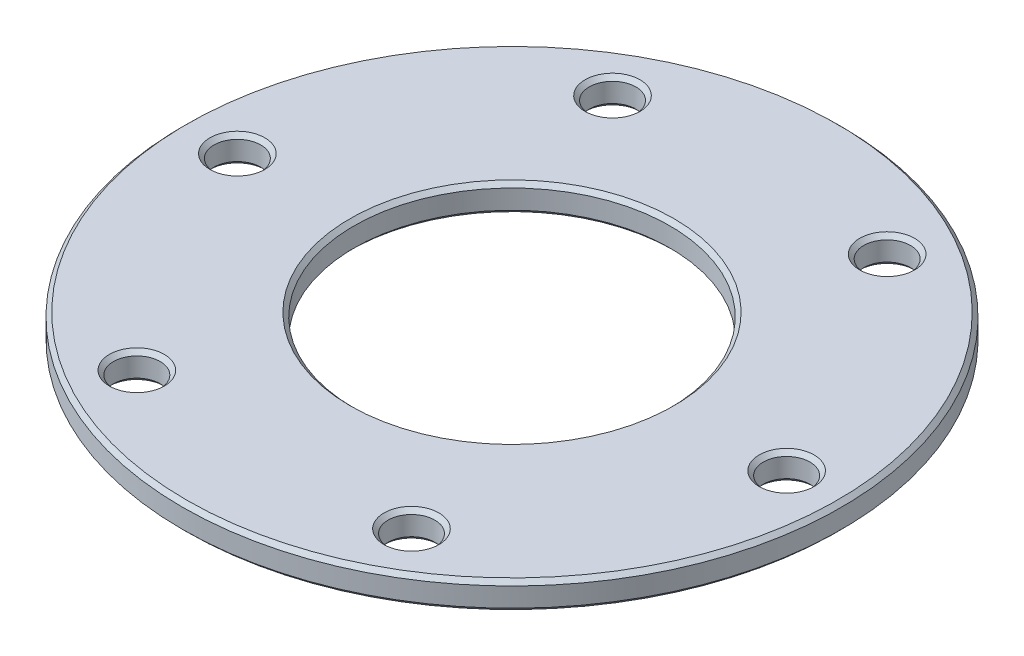
ISO-10303-21;
HEADER;
FILE_DESCRIPTION(('STEP AP214'),'2;1');
FILE_NAME('part.step','',(''),(''),'','','');
FILE_SCHEMA(('AUTOMOTIVE_DESIGN { 1 0 10303 214 1 1 1 1 }'));
ENDSEC;
DATA;
#1=APPLICATION_CONTEXT('core data for automotive mechanical design processes');
#2=APPLICATION_PROTOCOL_DEFINITION('international standard','automotive_design',2000,#1);
#3=PRODUCT_CONTEXT('',#1,'mechanical');
#4=PRODUCT('Part','Part','',(#3));
#5=PRODUCT_RELATED_PRODUCT_CATEGORY('part','',(#4));
#6=PRODUCT_DEFINITION_FORMATION('','',#4);
#7=PRODUCT_DEFINITION_CONTEXT('part definition',#1,'design');
#8=PRODUCT_DEFINITION('design','',#6,#7);
#9=PRODUCT_DEFINITION_SHAPE('','',#8);
#10=(LENGTH_UNIT() NAMED_UNIT(*) SI_UNIT(.MILLI.,.METRE.));
#11=(NAMED_UNIT(*) PLANE_ANGLE_UNIT() SI_UNIT($,.RADIAN.));
#12=(NAMED_UNIT(*) SI_UNIT($,.STERADIAN.) SOLID_ANGLE_UNIT());
#13=UNCERTAINTY_MEASURE_WITH_UNIT(LENGTH_MEASURE(1.E-05),#10,'distance_accuracy_value','');
#14=(GEOMETRIC_REPRESENTATION_CONTEXT(3) GLOBAL_UNCERTAINTY_ASSIGNED_CONTEXT((#13)) GLOBAL_UNIT_ASSIGNED_CONTEXT((#10,
#11,#12)) REPRESENTATION_CONTEXT('',''));
#15=CARTESIAN_POINT('',(0.,0.,0.));
#16=DIRECTION('',(0.,0.,1.));
#17=DIRECTION('',(1.,0.,0.));
#18=AXIS2_PLACEMENT_3D('',#15,#16,#17);
#19=CARTESIAN_POINT('',(0.,2.,0.));
#20=DIRECTION('',(0.,1.,0.));
#21=DIRECTION('',(0.,0.,1.));
#22=AXIS2_PLACEMENT_3D('',#19,#20,#21);
#23=PLANE('',#22);
#24=CARTESIAN_POINT('',(10.,2.,17.3205080756888));
#25=DIRECTION('',(0.,1.,0.));
#26=DIRECTION('',(0.,0.,1.));
#27=AXIS2_PLACEMENT_3D('',#24,#25,#26);
#28=CIRCLE('',#27,2.00000000000001);
#29=CARTESIAN_POINT('',(10.,2.,19.3205080756888));
#30=VERTEX_POINT('',#29);
#31=EDGE_CURVE('E105',#30,#30,#28,.F.);
#32=ORIENTED_EDGE('',*,*,#31,.T.);
#33=EDGE_LOOP('',(#32));
#34=FACE_BOUND('',#33,.T.);
#35=CARTESIAN_POINT('',(0.,2.,0.));
#36=DIRECTION('',(0.,1.,0.));
#37=DIRECTION('',(0.,0.,1.));
#38=AXIS2_PLACEMENT_3D('',#35,#36,#37);
#39=CIRCLE('',#38,11.8);
#40=CARTESIAN_POINT('',(0.,2.,11.8));
#41=VERTEX_POINT('',#40);
#42=EDGE_CURVE('E108',#41,#41,#39,.F.);
#43=ORIENTED_EDGE('',*,*,#42,.T.);
#44=EDGE_LOOP('',(#43));
#45=FACE_BOUND('',#44,.T.);
#46=CARTESIAN_POINT('',(0.,2.,0.));
#47=DIRECTION('',(0.,1.,0.));
#48=DIRECTION('',(0.,0.,1.));
#49=AXIS2_PLACEMENT_3D('',#46,#47,#48);
#50=CIRCLE('',#49,23.7);
#51=CARTESIAN_POINT('',(0.,2.,23.7));
#52=VERTEX_POINT('',#51);
#53=EDGE_CURVE('E111',#52,#52,#50,.T.);
#54=ORIENTED_EDGE('',*,*,#53,.T.);
#55=EDGE_LOOP('',(#54));
#56=FACE_BOUND('',#55,.T.);
#57=CARTESIAN_POINT('',(-10.,2.,-17.3205080756888));
#58=DIRECTION('',(0.,1.,0.));
#59=DIRECTION('',(0.,0.,1.));
#60=AXIS2_PLACEMENT_3D('',#57,#58,#59);
#61=CIRCLE('',#60,2.00000000000001);
#62=CARTESIAN_POINT('',(-10.,2.,-15.3205080756888));
#63=VERTEX_POINT('',#62);
#64=EDGE_CURVE('E114',#63,#63,#61,.F.);
#65=ORIENTED_EDGE('',*,*,#64,.T.);
#66=EDGE_LOOP('',(#65));
#67=FACE_BOUND('',#66,.T.);
#68=CARTESIAN_POINT('',(-20.,2.,0.));
#69=DIRECTION('',(0.,1.,0.));
#70=DIRECTION('',(0.,0.,1.));
#71=AXIS2_PLACEMENT_3D('',#68,#69,#70);
#72=CIRCLE('',#71,1.99999999999999);
#73=CARTESIAN_POINT('',(-20.,2.,1.99999999999999));
#74=VERTEX_POINT('',#73);
#75=EDGE_CURVE('E117',#74,#74,#72,.F.);
#76=ORIENTED_EDGE('',*,*,#75,.T.);
#77=EDGE_LOOP('',(#76));
#78=FACE_BOUND('',#77,.T.);
#79=CARTESIAN_POINT('',(9.99999999999999,2.,-17.3205080756888));
#80=DIRECTION('',(0.,1.,0.));
#81=DIRECTION('',(0.,0.,1.));
#82=AXIS2_PLACEMENT_3D('',#79,#80,#81);
#83=CIRCLE('',#82,2.00000000000001);
#84=CARTESIAN_POINT('',(9.99999999999999,2.,-15.3205080756888));
#85=VERTEX_POINT('',#84);
#86=EDGE_CURVE('E120',#85,#85,#83,.F.);
#87=ORIENTED_EDGE('',*,*,#86,.T.);
#88=EDGE_LOOP('',(#87));
#89=FACE_BOUND('',#88,.T.);
#90=CARTESIAN_POINT('',(20.,2.,0.));
#91=DIRECTION('',(0.,1.,0.));
#92=DIRECTION('',(0.,0.,1.));
#93=AXIS2_PLACEMENT_3D('',#90,#91,#92);
#94=CIRCLE('',#93,1.99999999999999);
#95=CARTESIAN_POINT('',(20.,2.,1.99999999999998));
#96=VERTEX_POINT('',#95);
#97=EDGE_CURVE('E123',#96,#96,#94,.F.);
#98=ORIENTED_EDGE('',*,*,#97,.T.);
#99=EDGE_LOOP('',(#98));
#100=FACE_BOUND('',#99,.T.);
#101=CARTESIAN_POINT('',(-9.99999999999998,2.,17.3205080756888));
#102=DIRECTION('',(0.,1.,0.));
#103=DIRECTION('',(0.,0.,1.));
#104=AXIS2_PLACEMENT_3D('',#101,#102,#103);
#105=CIRCLE('',#104,2.00000000000001);
#106=CARTESIAN_POINT('',(-9.99999999999998,2.,19.3205080756888));
#107=VERTEX_POINT('',#106);
#108=EDGE_CURVE('E126',#107,#107,#105,.F.);
#109=ORIENTED_EDGE('',*,*,#108,.T.);
#110=EDGE_LOOP('',(#109));
#111=FACE_BOUND('',#110,.T.);
#112=ADVANCED_FACE('F31',(#34,#45,#56,#67,#78,#89,#100,#111),#23,.T.);
#113=CARTESIAN_POINT('',(0.,0.,0.));
#114=DIRECTION('',(0.,1.,0.));
#115=DIRECTION('',(0.,0.,1.));
#116=AXIS2_PLACEMENT_3D('',#113,#114,#115);
#117=PLANE('',#116);
#118=CARTESIAN_POINT('',(10.,0.,17.3205080756888));
#119=DIRECTION('',(0.,1.,0.));
#120=DIRECTION('',(0.,0.,1.));
#121=AXIS2_PLACEMENT_3D('',#118,#119,#120);
#122=CIRCLE('',#121,2.);
#123=CARTESIAN_POINT('',(10.,0.,19.3205080756888));
#124=VERTEX_POINT('',#123);
#125=EDGE_CURVE('E81',#124,#124,#122,.T.);
#126=ORIENTED_EDGE('',*,*,#125,.T.);
#127=EDGE_LOOP('',(#126));
#128=FACE_BOUND('',#127,.T.);
#129=CARTESIAN_POINT('',(0.,0.,0.));
#130=DIRECTION('',(0.,1.,0.));
#131=DIRECTION('',(0.,0.,1.));
#132=AXIS2_PLACEMENT_3D('',#129,#130,#131);
#133=CIRCLE('',#132,11.8);
#134=CARTESIAN_POINT('',(0.,0.,11.8));
#135=VERTEX_POINT('',#134);
#136=EDGE_CURVE('E84',#135,#135,#133,.T.);
#137=ORIENTED_EDGE('',*,*,#136,.T.);
#138=EDGE_LOOP('',(#137));
#139=FACE_BOUND('',#138,.T.);
#140=CARTESIAN_POINT('',(0.,0.,0.));
#141=DIRECTION('',(0.,1.,0.));
#142=DIRECTION('',(0.,0.,1.));
#143=AXIS2_PLACEMENT_3D('',#140,#141,#142);
#144=CIRCLE('',#143,23.7);
#145=CARTESIAN_POINT('',(0.,0.,23.7));
#146=VERTEX_POINT('',#145);
#147=EDGE_CURVE('E87',#146,#146,#144,.F.);
#148=ORIENTED_EDGE('',*,*,#147,.T.);
#149=EDGE_LOOP('',(#148));
#150=FACE_BOUND('',#149,.T.);
#151=CARTESIAN_POINT('',(9.99999999999999,0.,-17.3205080756888));
#152=DIRECTION('',(0.,1.,0.));
#153=DIRECTION('',(0.,0.,1.));
#154=AXIS2_PLACEMENT_3D('',#151,#152,#153);
#155=CIRCLE('',#154,2.00000000000002);
#156=CARTESIAN_POINT('',(9.99999999999999,0.,-15.3205080756888));
#157=VERTEX_POINT('',#156);
#158=EDGE_CURVE('E90',#157,#157,#155,.T.);
#159=ORIENTED_EDGE('',*,*,#158,.T.);
#160=EDGE_LOOP('',(#159));
#161=FACE_BOUND('',#160,.T.);
#162=CARTESIAN_POINT('',(20.,0.,0.));
#163=DIRECTION('',(0.,1.,0.));
#164=DIRECTION('',(0.,0.,1.));
#165=AXIS2_PLACEMENT_3D('',#162,#163,#164);
#166=CIRCLE('',#165,1.99999999999998);
#167=CARTESIAN_POINT('',(20.,0.,1.99999999999998));
#168=VERTEX_POINT('',#167);
#169=EDGE_CURVE('E93',#168,#168,#166,.T.);
#170=ORIENTED_EDGE('',*,*,#169,.T.);
#171=EDGE_LOOP('',(#170));
#172=FACE_BOUND('',#171,.T.);
#173=CARTESIAN_POINT('',(-9.99999999999998,0.,17.3205080756888));
#174=DIRECTION('',(0.,1.,0.));
#175=DIRECTION('',(0.,0.,1.));
#176=AXIS2_PLACEMENT_3D('',#173,#174,#175);
#177=CIRCLE('',#176,2.);
#178=CARTESIAN_POINT('',(-9.99999999999998,0.,19.3205080756888));
#179=VERTEX_POINT('',#178);
#180=EDGE_CURVE('E96',#179,#179,#177,.T.);
#181=ORIENTED_EDGE('',*,*,#180,.T.);
#182=EDGE_LOOP('',(#181));
#183=FACE_BOUND('',#182,.T.);
#184=CARTESIAN_POINT('',(-20.,0.,0.));
#185=DIRECTION('',(0.,1.,0.));
#186=DIRECTION('',(0.,0.,1.));
#187=AXIS2_PLACEMENT_3D('',#184,#185,#186);
#188=CIRCLE('',#187,1.99999999999998);
#189=CARTESIAN_POINT('',(-20.,0.,1.99999999999998));
#190=VERTEX_POINT('',#189);
#191=EDGE_CURVE('E99',#190,#190,#188,.T.);
#192=ORIENTED_EDGE('',*,*,#191,.T.);
#193=EDGE_LOOP('',(#192));
#194=FACE_BOUND('',#193,.T.);
#195=CARTESIAN_POINT('',(-10.,0.,-17.3205080756888));
#196=DIRECTION('',(0.,1.,0.));
#197=DIRECTION('',(0.,0.,1.));
#198=AXIS2_PLACEMENT_3D('',#195,#196,#197);
#199=CIRCLE('',#198,2.00000000000001);
#200=CARTESIAN_POINT('',(-10.,0.,-15.3205080756888));
#201=VERTEX_POINT('',#200);
#202=EDGE_CURVE('E102',#201,#201,#199,.T.);
#203=ORIENTED_EDGE('',*,*,#202,.T.);
#204=EDGE_LOOP('',(#203));
#205=FACE_BOUND('',#204,.T.);
#206=ADVANCED_FACE('F146',(#128,#139,#150,#161,#172,#183,#194,#205),#117,.F.);
#207=CARTESIAN_POINT('',(0.,2.,0.));
#208=DIRECTION('',(0.,-1.,0.));
#209=DIRECTION('',(0.,0.,-1.));
#210=AXIS2_PLACEMENT_3D('',#207,#208,#209);
#211=CYLINDRICAL_SURFACE('',#210,24.);
#212=CARTESIAN_POINT('',(0.,0.300000000000002,0.));
#213=DIRECTION('',(0.,1.,0.));
#214=DIRECTION('',(0.,0.,1.));
#215=AXIS2_PLACEMENT_3D('',#212,#213,#214);
#216=CIRCLE('',#215,24.);
#217=CARTESIAN_POINT('',(0.,0.300000000000002,24.));
#218=VERTEX_POINT('',#217);
#219=EDGE_CURVE('E69',#218,#218,#216,.T.);
#220=ORIENTED_EDGE('',*,*,#219,.T.);
#221=EDGE_LOOP('',(#220));
#222=FACE_BOUND('',#221,.T.);
#223=CARTESIAN_POINT('',(0.,1.69999999999999,0.));
#224=DIRECTION('',(0.,1.,0.));
#225=DIRECTION('',(0.,0.,1.));
#226=AXIS2_PLACEMENT_3D('',#223,#224,#225);
#227=CIRCLE('',#226,24.);
#228=CARTESIAN_POINT('',(0.,1.69999999999999,24.));
#229=VERTEX_POINT('',#228);
#230=EDGE_CURVE('E72',#229,#229,#227,.F.);
#231=ORIENTED_EDGE('',*,*,#230,.T.);
#232=EDGE_LOOP('',(#231));
#233=FACE_BOUND('',#232,.T.);
#234=ADVANCED_FACE('F149',(#222,#233),#211,.T.);
#235=CARTESIAN_POINT('',(0.,2.,0.));
#236=DIRECTION('',(0.,-1.,0.));
#237=DIRECTION('',(0.,0.,-1.));
#238=AXIS2_PLACEMENT_3D('',#235,#236,#237);
#239=CYLINDRICAL_SURFACE('',#238,11.5);
#240=CARTESIAN_POINT('',(0.,0.300000000000009,0.));
#241=DIRECTION('',(0.,1.,0.));
#242=DIRECTION('',(0.,0.,1.));
#243=AXIS2_PLACEMENT_3D('',#240,#241,#242);
#244=CIRCLE('',#243,11.5);
#245=CARTESIAN_POINT('',(0.,0.300000000000009,11.5));
#246=VERTEX_POINT('',#245);
#247=EDGE_CURVE('E75',#246,#246,#244,.F.);
#248=ORIENTED_EDGE('',*,*,#247,.T.);
#249=EDGE_LOOP('',(#248));
#250=FACE_BOUND('',#249,.T.);
#251=CARTESIAN_POINT('',(0.,1.70000000000002,0.));
#252=DIRECTION('',(0.,1.,0.));
#253=DIRECTION('',(0.,0.,1.));
#254=AXIS2_PLACEMENT_3D('',#251,#252,#253);
#255=CIRCLE('',#254,11.5);
#256=CARTESIAN_POINT('',(0.,1.70000000000002,11.5));
#257=VERTEX_POINT('',#256);
#258=EDGE_CURVE('E78',#257,#257,#255,.T.);
#259=ORIENTED_EDGE('',*,*,#258,.T.);
#260=EDGE_LOOP('',(#259));
#261=FACE_BOUND('',#260,.T.);
#262=ADVANCED_FACE('F188',(#250,#261),#239,.F.);
#263=CARTESIAN_POINT('',(-10.,0.,-17.3205080756888));
#264=DIRECTION('',(0.,1.,0.));
#265=DIRECTION('',(0.,0.,1.));
#266=AXIS2_PLACEMENT_3D('',#263,#264,#265);
#267=CYLINDRICAL_SURFACE('',#266,1.7);
#268=CARTESIAN_POINT('',(-10.,0.30000000000001,-17.3205080756888));
#269=DIRECTION('',(0.,1.,0.));
#270=DIRECTION('',(0.,0.,1.));
#271=AXIS2_PLACEMENT_3D('',#268,#269,#270);
#272=CIRCLE('',#271,1.7);
#273=CARTESIAN_POINT('',(-10.,0.30000000000001,-15.6205080756888));
#274=VERTEX_POINT('',#273);
#275=EDGE_CURVE('E10',#274,#274,#272,.F.);
#276=ORIENTED_EDGE('',*,*,#275,.T.);
#277=EDGE_LOOP('',(#276));
#278=FACE_BOUND('',#277,.T.);
#279=CARTESIAN_POINT('',(-10.,1.69999999999999,-17.3205080756888));
#280=DIRECTION('',(0.,1.,0.));
#281=DIRECTION('',(0.,0.,1.));
#282=AXIS2_PLACEMENT_3D('',#279,#280,#281);
#283=CIRCLE('',#282,1.7);
#284=CARTESIAN_POINT('',(-10.,1.69999999999999,-15.6205080756888));
#285=VERTEX_POINT('',#284);
#286=EDGE_CURVE('E38',#285,#285,#283,.T.);
#287=ORIENTED_EDGE('',*,*,#286,.T.);
#288=EDGE_LOOP('',(#287));
#289=FACE_BOUND('',#288,.T.);
#290=ADVANCED_FACE('F266',(#278,#289),#267,.F.);
#291=CARTESIAN_POINT('',(9.99999999999999,0.,-17.3205080756888));
#292=DIRECTION('',(0.,1.,0.));
#293=DIRECTION('',(0.,0.,1.));
#294=AXIS2_PLACEMENT_3D('',#291,#292,#293);
#295=CYLINDRICAL_SURFACE('',#294,1.7);
#296=CARTESIAN_POINT('',(9.99999999999999,0.300000000000015,-17.3205080756888));
#297=DIRECTION('',(0.,1.,0.));
#298=DIRECTION('',(0.,0.,1.));
#299=AXIS2_PLACEMENT_3D('',#296,#297,#298);
#300=CIRCLE('',#299,1.7);
#301=CARTESIAN_POINT('',(9.99999999999999,0.300000000000015,-15.6205080756888));
#302=VERTEX_POINT('',#301);
#303=EDGE_CURVE('E63',#302,#302,#300,.F.);
#304=ORIENTED_EDGE('',*,*,#303,.T.);
#305=EDGE_LOOP('',(#304));
#306=FACE_BOUND('',#305,.T.);
#307=CARTESIAN_POINT('',(9.99999999999999,1.69999999999999,-17.3205080756888));
#308=DIRECTION('',(0.,1.,0.));
#309=DIRECTION('',(0.,0.,1.));
#310=AXIS2_PLACEMENT_3D('',#307,#308,#309);
#311=CIRCLE('',#310,1.7);
#312=CARTESIAN_POINT('',(9.99999999999999,1.69999999999999,-15.6205080756888));
#313=VERTEX_POINT('',#312);
#314=EDGE_CURVE('E66',#313,#313,#311,.T.);
#315=ORIENTED_EDGE('',*,*,#314,.T.);
#316=EDGE_LOOP('',(#315));
#317=FACE_BOUND('',#316,.T.);
#318=ADVANCED_FACE('F269',(#306,#317),#295,.F.);
#319=CARTESIAN_POINT('',(20.,0.,0.));
#320=DIRECTION('',(0.,1.,0.));
#321=DIRECTION('',(0.,0.,1.));
#322=AXIS2_PLACEMENT_3D('',#319,#320,#321);
#323=CYLINDRICAL_SURFACE('',#322,1.7);
#324=CARTESIAN_POINT('',(20.,0.299999999999982,0.));
#325=DIRECTION('',(0.,1.,0.));
#326=DIRECTION('',(0.,0.,1.));
#327=AXIS2_PLACEMENT_3D('',#324,#325,#326);
#328=CIRCLE('',#327,1.7);
#329=CARTESIAN_POINT('',(20.,0.299999999999982,1.69999999999999));
#330=VERTEX_POINT('',#329);
#331=EDGE_CURVE('E57',#330,#330,#328,.F.);
#332=ORIENTED_EDGE('',*,*,#331,.T.);
#333=EDGE_LOOP('',(#332));
#334=FACE_BOUND('',#333,.T.);
#335=CARTESIAN_POINT('',(20.,1.70000000000001,0.));
#336=DIRECTION('',(0.,1.,0.));
#337=DIRECTION('',(0.,0.,1.));
#338=AXIS2_PLACEMENT_3D('',#335,#336,#337);
#339=CIRCLE('',#338,1.7);
#340=CARTESIAN_POINT('',(20.,1.70000000000001,1.69999999999999));
#341=VERTEX_POINT('',#340);
#342=EDGE_CURVE('E60',#341,#341,#339,.T.);
#343=ORIENTED_EDGE('',*,*,#342,.T.);
#344=EDGE_LOOP('',(#343));
#345=FACE_BOUND('',#344,.T.);
#346=ADVANCED_FACE('F272',(#334,#345),#323,.F.);
#347=CARTESIAN_POINT('',(10.,0.,17.3205080756888));
#348=DIRECTION('',(0.,1.,0.));
#349=DIRECTION('',(0.,0.,1.));
#350=AXIS2_PLACEMENT_3D('',#347,#348,#349);
#351=CYLINDRICAL_SURFACE('',#350,1.7);
#352=CARTESIAN_POINT('',(10.,1.69999999999999,17.3205080756888));
#353=DIRECTION('',(0.,1.,0.));
#354=DIRECTION('',(0.,0.,1.));
#355=AXIS2_PLACEMENT_3D('',#352,#353,#354);
#356=CIRCLE('',#355,1.7);
#357=CARTESIAN_POINT('',(10.,1.69999999999999,19.0205080756888));
#358=VERTEX_POINT('',#357);
#359=EDGE_CURVE('E129',#358,#358,#356,.T.);
#360=ORIENTED_EDGE('',*,*,#359,.T.);
#361=EDGE_LOOP('',(#360));
#362=FACE_BOUND('',#361,.T.);
#363=CARTESIAN_POINT('',(10.,0.300000000000009,17.3205080756888));
#364=DIRECTION('',(0.,1.,0.));
#365=DIRECTION('',(0.,0.,1.));
#366=AXIS2_PLACEMENT_3D('',#363,#364,#365);
#367=CIRCLE('',#366,1.7);
#368=CARTESIAN_POINT('',(10.,0.300000000000009,19.0205080756888));
#369=VERTEX_POINT('',#368);
#370=EDGE_CURVE('E132',#369,#369,#367,.F.);
#371=ORIENTED_EDGE('',*,*,#370,.T.);
#372=EDGE_LOOP('',(#371));
#373=FACE_BOUND('',#372,.T.);
#374=ADVANCED_FACE('F136',(#362,#373),#351,.F.);
#375=CARTESIAN_POINT('',(-9.99999999999998,0.,17.3205080756888));
#376=DIRECTION('',(0.,1.,0.));
#377=DIRECTION('',(0.,0.,1.));
#378=AXIS2_PLACEMENT_3D('',#375,#376,#377);
#379=CYLINDRICAL_SURFACE('',#378,1.7);
#380=CARTESIAN_POINT('',(-9.99999999999998,0.300000000000009,17.3205080756888));
#381=DIRECTION('',(0.,1.,0.));
#382=DIRECTION('',(0.,0.,1.));
#383=AXIS2_PLACEMENT_3D('',#380,#381,#382);
#384=CIRCLE('',#383,1.7);
#385=CARTESIAN_POINT('',(-9.99999999999998,0.300000000000009,19.0205080756888));
#386=VERTEX_POINT('',#385);
#387=EDGE_CURVE('E51',#386,#386,#384,.F.);
#388=ORIENTED_EDGE('',*,*,#387,.T.);
#389=EDGE_LOOP('',(#388));
#390=FACE_BOUND('',#389,.T.);
#391=CARTESIAN_POINT('',(-9.99999999999998,1.69999999999999,17.3205080756888));
#392=DIRECTION('',(0.,1.,0.));
#393=DIRECTION('',(0.,0.,1.));
#394=AXIS2_PLACEMENT_3D('',#391,#392,#393);
#395=CIRCLE('',#394,1.7);
#396=CARTESIAN_POINT('',(-9.99999999999998,1.69999999999999,19.0205080756888));
#397=VERTEX_POINT('',#396);
#398=EDGE_CURVE('E54',#397,#397,#395,.T.);
#399=ORIENTED_EDGE('',*,*,#398,.T.);
#400=EDGE_LOOP('',(#399));
#401=FACE_BOUND('',#400,.T.);
#402=ADVANCED_FACE('F228',(#390,#401),#379,.F.);
#403=CARTESIAN_POINT('',(-20.,0.,0.));
#404=DIRECTION('',(0.,1.,0.));
#405=DIRECTION('',(0.,0.,1.));
#406=AXIS2_PLACEMENT_3D('',#403,#404,#405);
#407=CYLINDRICAL_SURFACE('',#406,1.7);
#408=CARTESIAN_POINT('',(-20.,0.299999999999982,0.));
#409=DIRECTION('',(0.,1.,0.));
#410=DIRECTION('',(0.,0.,1.));
#411=AXIS2_PLACEMENT_3D('',#408,#409,#410);
#412=CIRCLE('',#411,1.7);
#413=CARTESIAN_POINT('',(-20.,0.299999999999982,1.7));
#414=VERTEX_POINT('',#413);
#415=EDGE_CURVE('E42',#414,#414,#412,.F.);
#416=ORIENTED_EDGE('',*,*,#415,.T.);
#417=EDGE_LOOP('',(#416));
#418=FACE_BOUND('',#417,.T.);
#419=CARTESIAN_POINT('',(-20.,1.70000000000001,0.));
#420=DIRECTION('',(0.,1.,0.));
#421=DIRECTION('',(0.,0.,1.));
#422=AXIS2_PLACEMENT_3D('',#419,#420,#421);
#423=CIRCLE('',#422,1.7);
#424=CARTESIAN_POINT('',(-20.,1.70000000000001,1.7));
#425=VERTEX_POINT('',#424);
#426=EDGE_CURVE('E46',#425,#425,#423,.T.);
#427=ORIENTED_EDGE('',*,*,#426,.T.);
#428=EDGE_LOOP('',(#427));
#429=FACE_BOUND('',#428,.T.);
#430=ADVANCED_FACE('F195',(#418,#429),#407,.F.);
#431=CARTESIAN_POINT('',(10.,1.69999999999999,17.3205080756888));
#432=DIRECTION('',(0.,1.,0.));
#433=DIRECTION('',(0.,0.,1.));
#434=AXIS2_PLACEMENT_3D('',#431,#432,#433);
#435=CONICAL_SURFACE('',#434,1.7,0.785398163397453);
#436=ORIENTED_EDGE('',*,*,#31,.F.);
#437=EDGE_LOOP('',(#436));
#438=FACE_BOUND('',#437,.T.);
#439=ORIENTED_EDGE('',*,*,#359,.F.);
#440=EDGE_LOOP('',(#439));
#441=FACE_BOUND('',#440,.T.);
#442=ADVANCED_FACE('F142',(#438,#441),#435,.F.);
#443=CARTESIAN_POINT('',(10.,0.,17.3205080756888));
#444=DIRECTION('',(0.,-1.,0.));
#445=DIRECTION('',(0.,0.,-1.));
#446=AXIS2_PLACEMENT_3D('',#443,#444,#445);
#447=CONICAL_SURFACE('',#446,2.,0.785398163397437);
#448=ORIENTED_EDGE('',*,*,#370,.F.);
#449=EDGE_LOOP('',(#448));
#450=FACE_BOUND('',#449,.T.);
#451=ORIENTED_EDGE('',*,*,#125,.F.);
#452=EDGE_LOOP('',(#451));
#453=FACE_BOUND('',#452,.T.);
#454=ADVANCED_FACE('F138',(#450,#453),#447,.F.);
#455=CARTESIAN_POINT('',(0.,0.,0.));
#456=DIRECTION('',(0.,-1.,0.));
#457=DIRECTION('',(0.,0.,-1.));
#458=AXIS2_PLACEMENT_3D('',#455,#456,#457);
#459=CONICAL_SURFACE('',#458,11.8,0.785398163397443);
#460=ORIENTED_EDGE('',*,*,#247,.F.);
#461=EDGE_LOOP('',(#460));
#462=FACE_BOUND('',#461,.T.);
#463=ORIENTED_EDGE('',*,*,#136,.F.);
#464=EDGE_LOOP('',(#463));
#465=FACE_BOUND('',#464,.T.);
#466=ADVANCED_FACE('F141',(#462,#465),#459,.F.);
#467=CARTESIAN_POINT('',(0.,0.300000000000002,0.));
#468=DIRECTION('',(0.,1.,0.));
#469=DIRECTION('',(0.,0.,1.));
#470=AXIS2_PLACEMENT_3D('',#467,#468,#469);
#471=CONICAL_SURFACE('',#470,24.,0.785398163397443);
#472=ORIENTED_EDGE('',*,*,#147,.F.);
#473=EDGE_LOOP('',(#472));
#474=FACE_BOUND('',#473,.T.);
#475=ORIENTED_EDGE('',*,*,#219,.F.);
#476=EDGE_LOOP('',(#475));
#477=FACE_BOUND('',#476,.T.);
#478=ADVANCED_FACE('F200',(#474,#477),#471,.T.);
#479=CARTESIAN_POINT('',(0.,1.70000000000002,0.));
#480=DIRECTION('',(0.,1.,0.));
#481=DIRECTION('',(0.,0.,1.));
#482=AXIS2_PLACEMENT_3D('',#479,#480,#481);
#483=CONICAL_SURFACE('',#482,11.5,0.785398163397451);
#484=ORIENTED_EDGE('',*,*,#42,.F.);
#485=EDGE_LOOP('',(#484));
#486=FACE_BOUND('',#485,.T.);
#487=ORIENTED_EDGE('',*,*,#258,.F.);
#488=EDGE_LOOP('',(#487));
#489=FACE_BOUND('',#488,.T.);
#490=ADVANCED_FACE('F204',(#486,#489),#483,.F.);
#491=CARTESIAN_POINT('',(0.,2.,0.));
#492=DIRECTION('',(0.,-1.,0.));
#493=DIRECTION('',(0.,0.,-1.));
#494=AXIS2_PLACEMENT_3D('',#491,#492,#493);
#495=CONICAL_SURFACE('',#494,23.7,0.785398163397454);
#496=ORIENTED_EDGE('',*,*,#230,.F.);
#497=EDGE_LOOP('',(#496));
#498=FACE_BOUND('',#497,.T.);
#499=ORIENTED_EDGE('',*,*,#53,.F.);
#500=EDGE_LOOP('',(#499));
#501=FACE_BOUND('',#500,.T.);
#502=ADVANCED_FACE('F208',(#498,#501),#495,.T.);
#503=CARTESIAN_POINT('',(9.99999999999999,0.,-17.3205080756888));
#504=DIRECTION('',(0.,-1.,0.));
#505=DIRECTION('',(0.,0.,-1.));
#506=AXIS2_PLACEMENT_3D('',#503,#504,#505);
#507=CONICAL_SURFACE('',#506,2.00000000000002,0.785398163397451);
#508=ORIENTED_EDGE('',*,*,#303,.F.);
#509=EDGE_LOOP('',(#508));
#510=FACE_BOUND('',#509,.T.);
#511=ORIENTED_EDGE('',*,*,#158,.F.);
#512=EDGE_LOOP('',(#511));
#513=FACE_BOUND('',#512,.T.);
#514=ADVANCED_FACE('F212',(#510,#513),#507,.F.);
#515=CARTESIAN_POINT('',(20.,0.,0.));
#516=DIRECTION('',(0.,-1.,0.));
#517=DIRECTION('',(0.,0.,-1.));
#518=AXIS2_PLACEMENT_3D('',#515,#516,#517);
#519=CONICAL_SURFACE('',#518,1.99999999999998,0.785398163397448);
#520=ORIENTED_EDGE('',*,*,#331,.F.);
#521=EDGE_LOOP('',(#520));
#522=FACE_BOUND('',#521,.T.);
#523=ORIENTED_EDGE('',*,*,#169,.F.);
#524=EDGE_LOOP('',(#523));
#525=FACE_BOUND('',#524,.T.);
#526=ADVANCED_FACE('F216',(#522,#525),#519,.F.);
#527=CARTESIAN_POINT('',(-9.99999999999998,0.,17.3205080756888));
#528=DIRECTION('',(0.,-1.,0.));
#529=DIRECTION('',(0.,0.,-1.));
#530=AXIS2_PLACEMENT_3D('',#527,#528,#529);
#531=CONICAL_SURFACE('',#530,2.,0.785398163397437);
#532=ORIENTED_EDGE('',*,*,#387,.F.);
#533=EDGE_LOOP('',(#532));
#534=FACE_BOUND('',#533,.T.);
#535=ORIENTED_EDGE('',*,*,#180,.F.);
#536=EDGE_LOOP('',(#535));
#537=FACE_BOUND('',#536,.T.);
#538=ADVANCED_FACE('F178',(#534,#537),#531,.F.);
#539=CARTESIAN_POINT('',(-20.,0.,0.));
#540=DIRECTION('',(0.,-1.,0.));
#541=DIRECTION('',(0.,0.,-1.));
#542=AXIS2_PLACEMENT_3D('',#539,#540,#541);
#543=CONICAL_SURFACE('',#542,1.99999999999998,0.785398163397448);
#544=ORIENTED_EDGE('',*,*,#415,.F.);
#545=EDGE_LOOP('',(#544));
#546=FACE_BOUND('',#545,.T.);
#547=ORIENTED_EDGE('',*,*,#191,.F.);
#548=EDGE_LOOP('',(#547));
#549=FACE_BOUND('',#548,.T.);
#550=ADVANCED_FACE('F168',(#546,#549),#543,.F.);
#551=CARTESIAN_POINT('',(-10.,0.,-17.3205080756888));
#552=DIRECTION('',(0.,-1.,0.));
#553=DIRECTION('',(0.,0.,-1.));
#554=AXIS2_PLACEMENT_3D('',#551,#552,#553);
#555=CONICAL_SURFACE('',#554,2.00000000000001,0.78539816339745);
#556=ORIENTED_EDGE('',*,*,#275,.F.);
#557=EDGE_LOOP('',(#556));
#558=FACE_BOUND('',#557,.T.);
#559=ORIENTED_EDGE('',*,*,#202,.F.);
#560=EDGE_LOOP('',(#559));
#561=FACE_BOUND('',#560,.T.);
#562=ADVANCED_FACE('F165',(#558,#561),#555,.F.);
#563=CARTESIAN_POINT('',(-10.,1.69999999999999,-17.3205080756888));
#564=DIRECTION('',(0.,1.,0.));
#565=DIRECTION('',(0.,0.,1.));
#566=AXIS2_PLACEMENT_3D('',#563,#564,#565);
#567=CONICAL_SURFACE('',#566,1.7,0.785398163397454);
#568=ORIENTED_EDGE('',*,*,#64,.F.);
#569=EDGE_LOOP('',(#568));
#570=FACE_BOUND('',#569,.T.);
#571=ORIENTED_EDGE('',*,*,#286,.F.);
#572=EDGE_LOOP('',(#571));
#573=FACE_BOUND('',#572,.T.);
#574=ADVANCED_FACE('F167',(#570,#573),#567,.F.);
#575=CARTESIAN_POINT('',(-20.,1.70000000000001,0.));
#576=DIRECTION('',(0.,1.,0.));
#577=DIRECTION('',(0.,0.,1.));
#578=AXIS2_PLACEMENT_3D('',#575,#576,#577);
#579=CONICAL_SURFACE('',#578,1.7,0.785398163397453);
#580=ORIENTED_EDGE('',*,*,#75,.F.);
#581=EDGE_LOOP('',(#580));
#582=FACE_BOUND('',#581,.T.);
#583=ORIENTED_EDGE('',*,*,#426,.F.);
#584=EDGE_LOOP('',(#583));
#585=FACE_BOUND('',#584,.T.);
#586=ADVANCED_FACE('F175',(#582,#585),#579,.F.);
#587=CARTESIAN_POINT('',(9.99999999999999,1.69999999999999,-17.3205080756888));
#588=DIRECTION('',(0.,1.,0.));
#589=DIRECTION('',(0.,0.,1.));
#590=AXIS2_PLACEMENT_3D('',#587,#588,#589);
#591=CONICAL_SURFACE('',#590,1.7,0.785398163397453);
#592=ORIENTED_EDGE('',*,*,#86,.F.);
#593=EDGE_LOOP('',(#592));
#594=FACE_BOUND('',#593,.T.);
#595=ORIENTED_EDGE('',*,*,#314,.F.);
#596=EDGE_LOOP('',(#595));
#597=FACE_BOUND('',#596,.T.);
#598=ADVANCED_FACE('F240',(#594,#597),#591,.F.);
#599=CARTESIAN_POINT('',(20.,1.70000000000001,0.));
#600=DIRECTION('',(0.,1.,0.));
#601=DIRECTION('',(0.,0.,1.));
#602=AXIS2_PLACEMENT_3D('',#599,#600,#601);
#603=CONICAL_SURFACE('',#602,1.7,0.785398163397453);
#604=ORIENTED_EDGE('',*,*,#97,.F.);
#605=EDGE_LOOP('',(#604));
#606=FACE_BOUND('',#605,.T.);
#607=ORIENTED_EDGE('',*,*,#342,.F.);
#608=EDGE_LOOP('',(#607));
#609=FACE_BOUND('',#608,.T.);
#610=ADVANCED_FACE('F235',(#606,#609),#603,.F.);
#611=CARTESIAN_POINT('',(-9.99999999999998,1.69999999999999,17.3205080756888));
#612=DIRECTION('',(0.,1.,0.));
#613=DIRECTION('',(0.,0.,1.));
#614=AXIS2_PLACEMENT_3D('',#611,#612,#613);
#615=CONICAL_SURFACE('',#614,1.7,0.785398163397453);
#616=ORIENTED_EDGE('',*,*,#108,.F.);
#617=EDGE_LOOP('',(#616));
#618=FACE_BOUND('',#617,.T.);
#619=ORIENTED_EDGE('',*,*,#398,.F.);
#620=EDGE_LOOP('',(#619));
#621=FACE_BOUND('',#620,.T.);
#622=ADVANCED_FACE('F33',(#618,#621),#615,.F.);
#623=CLOSED_SHELL('',(#112,#206,#234,#262,#290,#318,#346,#374,#402,#430,#442,#454,#466,#478,
#490,#502,#514,#526,#538,#550,#562,#574,#586,#598,#610,#622));
#624=MANIFOLD_SOLID_BREP('B2',#623);
#625=ADVANCED_BREP_SHAPE_REPRESENTATION('',(#18,#624),#14);
#626=SHAPE_DEFINITION_REPRESENTATION(#9,#625);
ENDSEC;
END-ISO-10303-21;
